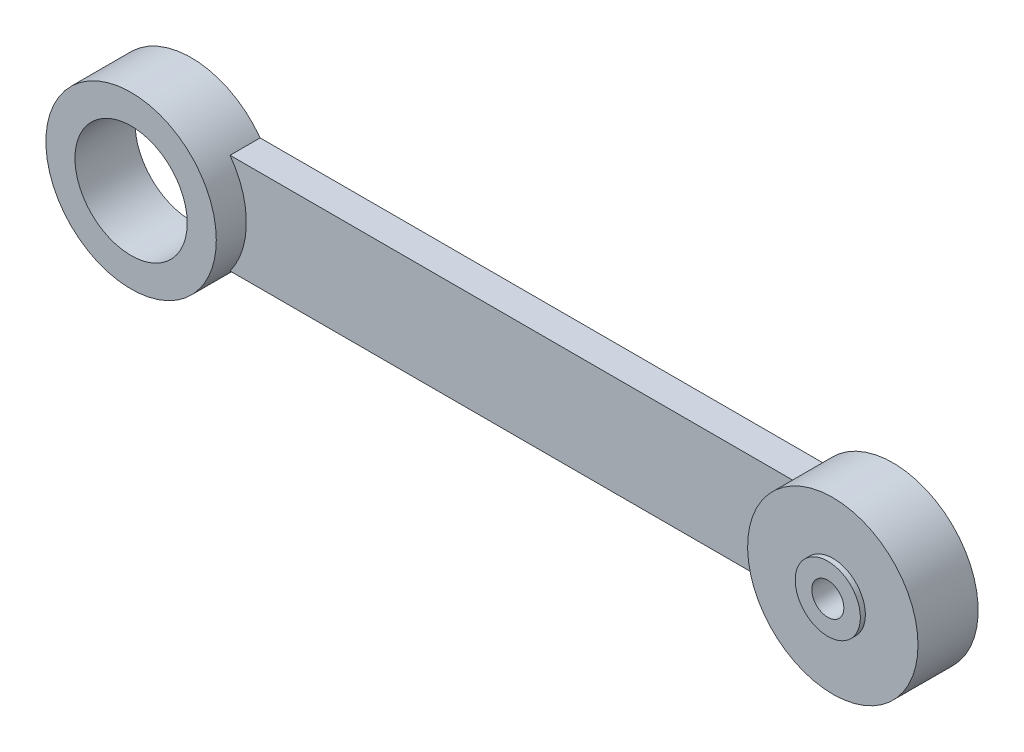
ISO-10303-21;
HEADER;
FILE_DESCRIPTION(('STEP AP214'),'2;1');
FILE_NAME('part.step','',(''),(''),'','','');
FILE_SCHEMA(('AUTOMOTIVE_DESIGN { 1 0 10303 214 1 1 1 1 }'));
ENDSEC;
DATA;
#1=APPLICATION_CONTEXT('core data for automotive mechanical design processes');
#2=APPLICATION_PROTOCOL_DEFINITION('international standard','automotive_design',2000,#1);
#3=PRODUCT_CONTEXT('',#1,'mechanical');
#4=PRODUCT('Part','Part','',(#3));
#5=PRODUCT_RELATED_PRODUCT_CATEGORY('part','',(#4));
#6=PRODUCT_DEFINITION_FORMATION('','',#4);
#7=PRODUCT_DEFINITION_CONTEXT('part definition',#1,'design');
#8=PRODUCT_DEFINITION('design','',#6,#7);
#9=PRODUCT_DEFINITION_SHAPE('','',#8);
#10=(LENGTH_UNIT() NAMED_UNIT(*) SI_UNIT(.MILLI.,.METRE.));
#11=(NAMED_UNIT(*) PLANE_ANGLE_UNIT() SI_UNIT($,.RADIAN.));
#12=(NAMED_UNIT(*) SI_UNIT($,.STERADIAN.) SOLID_ANGLE_UNIT());
#13=UNCERTAINTY_MEASURE_WITH_UNIT(LENGTH_MEASURE(1.E-05),#10,'distance_accuracy_value','');
#14=(GEOMETRIC_REPRESENTATION_CONTEXT(3) GLOBAL_UNCERTAINTY_ASSIGNED_CONTEXT((#13)) GLOBAL_UNIT_ASSIGNED_CONTEXT((#10,
#11,#12)) REPRESENTATION_CONTEXT('',''));
#15=CARTESIAN_POINT('',(0.,0.,0.));
#16=DIRECTION('',(0.,0.,1.));
#17=DIRECTION('',(1.,0.,0.));
#18=AXIS2_PLACEMENT_3D('',#15,#16,#17);
#19=CARTESIAN_POINT('',(70.,0.,6.));
#20=DIRECTION('',(0.,0.,1.));
#21=DIRECTION('',(1.,0.,0.));
#22=AXIS2_PLACEMENT_3D('',#19,#20,#21);
#23=PLANE('',#22);
#24=CARTESIAN_POINT('',(70.,0.,6.));
#25=DIRECTION('',(0.,0.,1.));
#26=DIRECTION('',(1.,0.,0.));
#27=AXIS2_PLACEMENT_3D('',#24,#25,#26);
#28=CIRCLE('',#27,8.5);
#29=CARTESIAN_POINT('',(78.5,0.,6.));
#30=VERTEX_POINT('',#29);
#31=EDGE_CURVE('E146',#30,#30,#28,.T.);
#32=ORIENTED_EDGE('',*,*,#31,.T.);
#33=EDGE_LOOP('',(#32));
#34=FACE_BOUND('',#33,.T.);
#35=CARTESIAN_POINT('',(70.,0.,6.));
#36=DIRECTION('',(0.,0.,1.));
#37=DIRECTION('',(1.,0.,0.));
#38=AXIS2_PLACEMENT_3D('',#35,#36,#37);
#39=CIRCLE('',#38,3.25000000000001);
#40=CARTESIAN_POINT('',(73.25,0.,6.));
#41=VERTEX_POINT('',#40);
#42=EDGE_CURVE('E159',#41,#41,#39,.T.);
#43=ORIENTED_EDGE('',*,*,#42,.F.);
#44=EDGE_LOOP('',(#43));
#45=FACE_BOUND('',#44,.T.);
#46=ADVANCED_FACE('F43',(#34,#45),#23,.T.);
#47=CARTESIAN_POINT('',(0.,0.,3.));
#48=DIRECTION('',(0.,0.,1.));
#49=DIRECTION('',(1.,0.,0.));
#50=AXIS2_PLACEMENT_3D('',#47,#48,#49);
#51=PLANE('',#50);
#52=DIRECTION('',(1.,0.,0.));
#53=VECTOR('',#52,1.);
#54=CARTESIAN_POINT('',(6.87386354243376,-5.,3.));
#55=LINE('',#54,#53);
#56=CARTESIAN_POINT('',(6.87386354243376,-5.,3.));
#57=VERTEX_POINT('',#56);
#58=CARTESIAN_POINT('',(63.1261364575662,-5.,3.));
#59=VERTEX_POINT('',#58);
#60=EDGE_CURVE('E62',#57,#59,#55,.T.);
#61=ORIENTED_EDGE('',*,*,#60,.T.);
#62=CARTESIAN_POINT('',(70.,0.,3.));
#63=DIRECTION('',(0.,0.,1.));
#64=DIRECTION('',(1.,0.,0.));
#65=AXIS2_PLACEMENT_3D('',#62,#63,#64);
#66=CIRCLE('',#65,8.5);
#67=CARTESIAN_POINT('',(63.1261364575662,5.,3.));
#68=VERTEX_POINT('',#67);
#69=EDGE_CURVE('E128',#59,#68,#66,.F.);
#70=ORIENTED_EDGE('',*,*,#69,.T.);
#71=DIRECTION('',(-1.,0.,0.));
#72=VECTOR('',#71,1.);
#73=CARTESIAN_POINT('',(6.87386354243376,5.,3.));
#74=LINE('',#73,#72);
#75=CARTESIAN_POINT('',(6.87386354243376,5.,3.));
#76=VERTEX_POINT('',#75);
#77=EDGE_CURVE('E104',#68,#76,#74,.T.);
#78=ORIENTED_EDGE('',*,*,#77,.T.);
#79=CARTESIAN_POINT('',(0.,0.,3.));
#80=DIRECTION('',(0.,0.,1.));
#81=DIRECTION('',(1.,0.,0.));
#82=AXIS2_PLACEMENT_3D('',#79,#80,#81);
#83=CIRCLE('',#82,8.5);
#84=EDGE_CURVE('E101',#76,#57,#83,.F.);
#85=ORIENTED_EDGE('',*,*,#84,.T.);
#86=EDGE_LOOP('',(#61,#70,#78,#85));
#87=FACE_BOUND('',#86,.T.);
#88=ADVANCED_FACE('F190',(#87),#51,.T.);
#89=CARTESIAN_POINT('',(0.,0.,0.));
#90=DIRECTION('',(0.,0.,1.));
#91=DIRECTION('',(1.,0.,0.));
#92=AXIS2_PLACEMENT_3D('',#89,#90,#91);
#93=PLANE('',#92);
#94=CARTESIAN_POINT('',(70.,0.,0.));
#95=DIRECTION('',(0.,0.,1.));
#96=DIRECTION('',(1.,0.,0.));
#97=AXIS2_PLACEMENT_3D('',#94,#95,#96);
#98=CIRCLE('',#97,3.3);
#99=CARTESIAN_POINT('',(73.3,0.,0.));
#100=VERTEX_POINT('',#99);
#101=EDGE_CURVE('E150',#100,#100,#98,.T.);
#102=ORIENTED_EDGE('',*,*,#101,.T.);
#103=EDGE_LOOP('',(#102));
#104=FACE_BOUND('',#103,.T.);
#105=CARTESIAN_POINT('',(70.,0.,0.));
#106=DIRECTION('',(0.,0.,1.));
#107=DIRECTION('',(-1.,0.,0.));
#108=AXIS2_PLACEMENT_3D('',#105,#106,#107);
#109=CIRCLE('',#108,8.5);
#110=CARTESIAN_POINT('',(63.1261364575662,-5.,0.));
#111=VERTEX_POINT('',#110);
#112=CARTESIAN_POINT('',(63.1261364575662,5.,0.));
#113=VERTEX_POINT('',#112);
#114=EDGE_CURVE('E79',#111,#113,#109,.T.);
#115=ORIENTED_EDGE('',*,*,#114,.F.);
#116=DIRECTION('',(1.,0.,0.));
#117=VECTOR('',#116,1.);
#118=CARTESIAN_POINT('',(6.87386354243376,-5.,0.));
#119=LINE('',#118,#117);
#120=CARTESIAN_POINT('',(6.87386354243376,-5.,0.));
#121=VERTEX_POINT('',#120);
#122=EDGE_CURVE('E108',#121,#111,#119,.T.);
#123=ORIENTED_EDGE('',*,*,#122,.F.);
#124=CARTESIAN_POINT('',(0.,0.,0.));
#125=DIRECTION('',(0.,0.,1.));
#126=DIRECTION('',(1.,0.,0.));
#127=AXIS2_PLACEMENT_3D('',#124,#125,#126);
#128=CIRCLE('',#127,8.5);
#129=CARTESIAN_POINT('',(6.87386354243376,5.,0.));
#130=VERTEX_POINT('',#129);
#131=EDGE_CURVE('E100',#130,#121,#128,.T.);
#132=ORIENTED_EDGE('',*,*,#131,.F.);
#133=DIRECTION('',(-1.,0.,0.));
#134=VECTOR('',#133,1.);
#135=CARTESIAN_POINT('',(6.87386354243376,5.,0.));
#136=LINE('',#135,#134);
#137=EDGE_CURVE('E85',#113,#130,#136,.T.);
#138=ORIENTED_EDGE('',*,*,#137,.F.);
#139=EDGE_LOOP('',(#115,#123,#132,#138));
#140=FACE_BOUND('',#139,.T.);
#141=CARTESIAN_POINT('',(0.,0.,0.));
#142=DIRECTION('',(0.,0.,1.));
#143=DIRECTION('',(1.,0.,0.));
#144=AXIS2_PLACEMENT_3D('',#141,#142,#143);
#145=CIRCLE('',#144,5.6);
#146=CARTESIAN_POINT('',(5.6,0.,0.));
#147=VERTEX_POINT('',#146);
#148=EDGE_CURVE('E110',#147,#147,#145,.T.);
#149=ORIENTED_EDGE('',*,*,#148,.T.);
#150=EDGE_LOOP('',(#149));
#151=FACE_BOUND('',#150,.T.);
#152=ADVANCED_FACE('F106',(#104,#140,#151),#93,.F.);
#153=CARTESIAN_POINT('',(0.,0.,3.));
#154=DIRECTION('',(0.,0.,-1.));
#155=DIRECTION('',(-1.,0.,0.));
#156=AXIS2_PLACEMENT_3D('',#153,#154,#155);
#157=CYLINDRICAL_SURFACE('',#156,8.5);
#158=ORIENTED_EDGE('',*,*,#131,.T.);
#159=DIRECTION('',(0.,0.,-1.));
#160=VECTOR('',#159,1.);
#161=CARTESIAN_POINT('',(6.87386354243376,-5.,3.));
#162=LINE('',#161,#160);
#163=EDGE_CURVE('E11',#57,#121,#162,.T.);
#164=ORIENTED_EDGE('',*,*,#163,.F.);
#165=ORIENTED_EDGE('',*,*,#84,.F.);
#166=DIRECTION('',(0.,0.,-1.));
#167=VECTOR('',#166,1.);
#168=CARTESIAN_POINT('',(6.87386354243376,5.,3.));
#169=LINE('',#168,#167);
#170=EDGE_CURVE('E89',#76,#130,#169,.T.);
#171=ORIENTED_EDGE('',*,*,#170,.T.);
#172=EDGE_LOOP('',(#158,#164,#165,#171));
#173=FACE_BOUND('',#172,.T.);
#174=CARTESIAN_POINT('',(0.,0.,6.));
#175=DIRECTION('',(0.,0.,1.));
#176=DIRECTION('',(1.,0.,0.));
#177=AXIS2_PLACEMENT_3D('',#174,#175,#176);
#178=CIRCLE('',#177,8.5);
#179=CARTESIAN_POINT('',(8.5,0.,6.));
#180=VERTEX_POINT('',#179);
#181=EDGE_CURVE('E136',#180,#180,#178,.T.);
#182=ORIENTED_EDGE('',*,*,#181,.F.);
#183=EDGE_LOOP('',(#182));
#184=FACE_BOUND('',#183,.T.);
#185=ADVANCED_FACE('F45',(#173,#184),#157,.T.);
#186=CARTESIAN_POINT('',(6.87386354243376,-5.,3.));
#187=DIRECTION('',(0.,1.,0.));
#188=DIRECTION('',(0.,0.,1.));
#189=AXIS2_PLACEMENT_3D('',#186,#187,#188);
#190=PLANE('',#189);
#191=ORIENTED_EDGE('',*,*,#122,.T.);
#192=DIRECTION('',(0.,0.,-1.));
#193=VECTOR('',#192,1.);
#194=CARTESIAN_POINT('',(63.1261364575662,-5.,3.));
#195=LINE('',#194,#193);
#196=EDGE_CURVE('E54',#59,#111,#195,.T.);
#197=ORIENTED_EDGE('',*,*,#196,.F.);
#198=ORIENTED_EDGE('',*,*,#60,.F.);
#199=ORIENTED_EDGE('',*,*,#163,.T.);
#200=EDGE_LOOP('',(#191,#197,#198,#199));
#201=FACE_BOUND('',#200,.T.);
#202=ADVANCED_FACE('F130',(#201),#190,.F.);
#203=CARTESIAN_POINT('',(70.,0.,3.));
#204=DIRECTION('',(0.,0.,-1.));
#205=DIRECTION('',(-1.,0.,0.));
#206=AXIS2_PLACEMENT_3D('',#203,#204,#205);
#207=CYLINDRICAL_SURFACE('',#206,8.5);
#208=ORIENTED_EDGE('',*,*,#114,.T.);
#209=DIRECTION('',(0.,0.,-1.));
#210=VECTOR('',#209,1.);
#211=CARTESIAN_POINT('',(63.1261364575662,5.,3.));
#212=LINE('',#211,#210);
#213=EDGE_CURVE('E90',#68,#113,#212,.T.);
#214=ORIENTED_EDGE('',*,*,#213,.F.);
#215=ORIENTED_EDGE('',*,*,#69,.F.);
#216=ORIENTED_EDGE('',*,*,#196,.T.);
#217=EDGE_LOOP('',(#208,#214,#215,#216));
#218=FACE_BOUND('',#217,.T.);
#219=ORIENTED_EDGE('',*,*,#31,.F.);
#220=EDGE_LOOP('',(#219));
#221=FACE_BOUND('',#220,.T.);
#222=ADVANCED_FACE('F126',(#218,#221),#207,.T.);
#223=CARTESIAN_POINT('',(6.87386354243376,5.,3.));
#224=DIRECTION('',(0.,-1.,0.));
#225=DIRECTION('',(0.,0.,-1.));
#226=AXIS2_PLACEMENT_3D('',#223,#224,#225);
#227=PLANE('',#226);
#228=ORIENTED_EDGE('',*,*,#137,.T.);
#229=ORIENTED_EDGE('',*,*,#170,.F.);
#230=ORIENTED_EDGE('',*,*,#77,.F.);
#231=ORIENTED_EDGE('',*,*,#213,.T.);
#232=EDGE_LOOP('',(#228,#229,#230,#231));
#233=FACE_BOUND('',#232,.T.);
#234=ADVANCED_FACE('F87',(#233),#227,.F.);
#235=CARTESIAN_POINT('',(0.,0.,3.));
#236=DIRECTION('',(0.,0.,-1.));
#237=DIRECTION('',(-1.,0.,0.));
#238=AXIS2_PLACEMENT_3D('',#235,#236,#237);
#239=CYLINDRICAL_SURFACE('',#238,5.6);
#240=ORIENTED_EDGE('',*,*,#148,.F.);
#241=EDGE_LOOP('',(#240));
#242=FACE_BOUND('',#241,.T.);
#243=CARTESIAN_POINT('',(0.,0.,6.));
#244=DIRECTION('',(0.,0.,1.));
#245=DIRECTION('',(1.,0.,0.));
#246=AXIS2_PLACEMENT_3D('',#243,#244,#245);
#247=CIRCLE('',#246,5.6);
#248=CARTESIAN_POINT('',(5.6,0.,6.));
#249=VERTEX_POINT('',#248);
#250=EDGE_CURVE('E140',#249,#249,#247,.T.);
#251=ORIENTED_EDGE('',*,*,#250,.T.);
#252=EDGE_LOOP('',(#251));
#253=FACE_BOUND('',#252,.T.);
#254=ADVANCED_FACE('F206',(#242,#253),#239,.F.);
#255=CARTESIAN_POINT('',(0.,0.,6.));
#256=DIRECTION('',(0.,0.,1.));
#257=DIRECTION('',(1.,0.,0.));
#258=AXIS2_PLACEMENT_3D('',#255,#256,#257);
#259=PLANE('',#258);
#260=ORIENTED_EDGE('',*,*,#181,.T.);
#261=EDGE_LOOP('',(#260));
#262=FACE_BOUND('',#261,.T.);
#263=ORIENTED_EDGE('',*,*,#250,.F.);
#264=EDGE_LOOP('',(#263));
#265=FACE_BOUND('',#264,.T.);
#266=ADVANCED_FACE('F203',(#262,#265),#259,.T.);
#267=CARTESIAN_POINT('',(70.,0.,6.));
#268=DIRECTION('',(0.,0.,-1.));
#269=DIRECTION('',(-1.,0.,0.));
#270=AXIS2_PLACEMENT_3D('',#267,#268,#269);
#271=CYLINDRICAL_SURFACE('',#270,1.60000000000001);
#272=CARTESIAN_POINT('',(70.,0.,1.5));
#273=DIRECTION('',(0.,0.,1.));
#274=DIRECTION('',(1.,0.,0.));
#275=AXIS2_PLACEMENT_3D('',#272,#273,#274);
#276=CIRCLE('',#275,1.60000000000001);
#277=CARTESIAN_POINT('',(71.6,0.,1.5));
#278=VERTEX_POINT('',#277);
#279=EDGE_CURVE('E47',#278,#278,#276,.T.);
#280=ORIENTED_EDGE('',*,*,#279,.F.);
#281=EDGE_LOOP('',(#280));
#282=FACE_BOUND('',#281,.T.);
#283=CARTESIAN_POINT('',(70.,0.,6.5));
#284=DIRECTION('',(0.,0.,1.));
#285=DIRECTION('',(1.,0.,0.));
#286=AXIS2_PLACEMENT_3D('',#283,#284,#285);
#287=CIRCLE('',#286,1.60000000000001);
#288=CARTESIAN_POINT('',(71.6,0.,6.5));
#289=VERTEX_POINT('',#288);
#290=EDGE_CURVE('E163',#289,#289,#287,.T.);
#291=ORIENTED_EDGE('',*,*,#290,.T.);
#292=EDGE_LOOP('',(#291));
#293=FACE_BOUND('',#292,.T.);
#294=ADVANCED_FACE('F171',(#282,#293),#271,.F.);
#295=CARTESIAN_POINT('',(70.,0.,1.5));
#296=DIRECTION('',(0.,0.,-1.));
#297=DIRECTION('',(-1.,0.,0.));
#298=AXIS2_PLACEMENT_3D('',#295,#296,#297);
#299=CYLINDRICAL_SURFACE('',#298,3.3);
#300=CARTESIAN_POINT('',(70.,0.,1.5));
#301=DIRECTION('',(0.,0.,1.));
#302=DIRECTION('',(1.,0.,0.));
#303=AXIS2_PLACEMENT_3D('',#300,#301,#302);
#304=CIRCLE('',#303,3.3);
#305=CARTESIAN_POINT('',(73.3,0.,1.5));
#306=VERTEX_POINT('',#305);
#307=EDGE_CURVE('E154',#306,#306,#304,.T.);
#308=ORIENTED_EDGE('',*,*,#307,.T.);
#309=EDGE_LOOP('',(#308));
#310=FACE_BOUND('',#309,.T.);
#311=ORIENTED_EDGE('',*,*,#101,.F.);
#312=EDGE_LOOP('',(#311));
#313=FACE_BOUND('',#312,.T.);
#314=ADVANCED_FACE('F186',(#310,#313),#299,.F.);
#315=CARTESIAN_POINT('',(70.,0.,1.5));
#316=DIRECTION('',(0.,0.,1.));
#317=DIRECTION('',(1.,0.,0.));
#318=AXIS2_PLACEMENT_3D('',#315,#316,#317);
#319=PLANE('',#318);
#320=ORIENTED_EDGE('',*,*,#279,.T.);
#321=EDGE_LOOP('',(#320));
#322=FACE_BOUND('',#321,.T.);
#323=ORIENTED_EDGE('',*,*,#307,.F.);
#324=EDGE_LOOP('',(#323));
#325=FACE_BOUND('',#324,.T.);
#326=ADVANCED_FACE('F176',(#322,#325),#319,.F.);
#327=CARTESIAN_POINT('',(70.,0.,6.5));
#328=DIRECTION('',(0.,0.,1.));
#329=DIRECTION('',(1.,0.,0.));
#330=AXIS2_PLACEMENT_3D('',#327,#328,#329);
#331=PLANE('',#330);
#332=CARTESIAN_POINT('',(70.,0.,6.5));
#333=DIRECTION('',(0.,0.,1.));
#334=DIRECTION('',(1.,0.,0.));
#335=AXIS2_PLACEMENT_3D('',#332,#333,#334);
#336=CIRCLE('',#335,3.25000000000001);
#337=CARTESIAN_POINT('',(73.25,0.,6.5));
#338=VERTEX_POINT('',#337);
#339=EDGE_CURVE('E155',#338,#338,#336,.T.);
#340=ORIENTED_EDGE('',*,*,#339,.T.);
#341=EDGE_LOOP('',(#340));
#342=FACE_BOUND('',#341,.T.);
#343=ORIENTED_EDGE('',*,*,#290,.F.);
#344=EDGE_LOOP('',(#343));
#345=FACE_BOUND('',#344,.T.);
#346=ADVANCED_FACE('F173',(#342,#345),#331,.T.);
#347=CARTESIAN_POINT('',(70.,0.,6.5));
#348=DIRECTION('',(0.,0.,-1.));
#349=DIRECTION('',(-1.,0.,0.));
#350=AXIS2_PLACEMENT_3D('',#347,#348,#349);
#351=CYLINDRICAL_SURFACE('',#350,3.25000000000001);
#352=ORIENTED_EDGE('',*,*,#339,.F.);
#353=EDGE_LOOP('',(#352));
#354=FACE_BOUND('',#353,.T.);
#355=ORIENTED_EDGE('',*,*,#42,.T.);
#356=EDGE_LOOP('',(#355));
#357=FACE_BOUND('',#356,.T.);
#358=ADVANCED_FACE('F175',(#354,#357),#351,.T.);
#359=CLOSED_SHELL('',(#46,#88,#152,#185,#202,#222,#234,#254,#266,#294,#314,#326,#346,#358));
#360=MANIFOLD_SOLID_BREP('B2',#359);
#361=ADVANCED_BREP_SHAPE_REPRESENTATION('',(#18,#360),#14);
#362=SHAPE_DEFINITION_REPRESENTATION(#9,#361);
ENDSEC;
END-ISO-10303-21;
